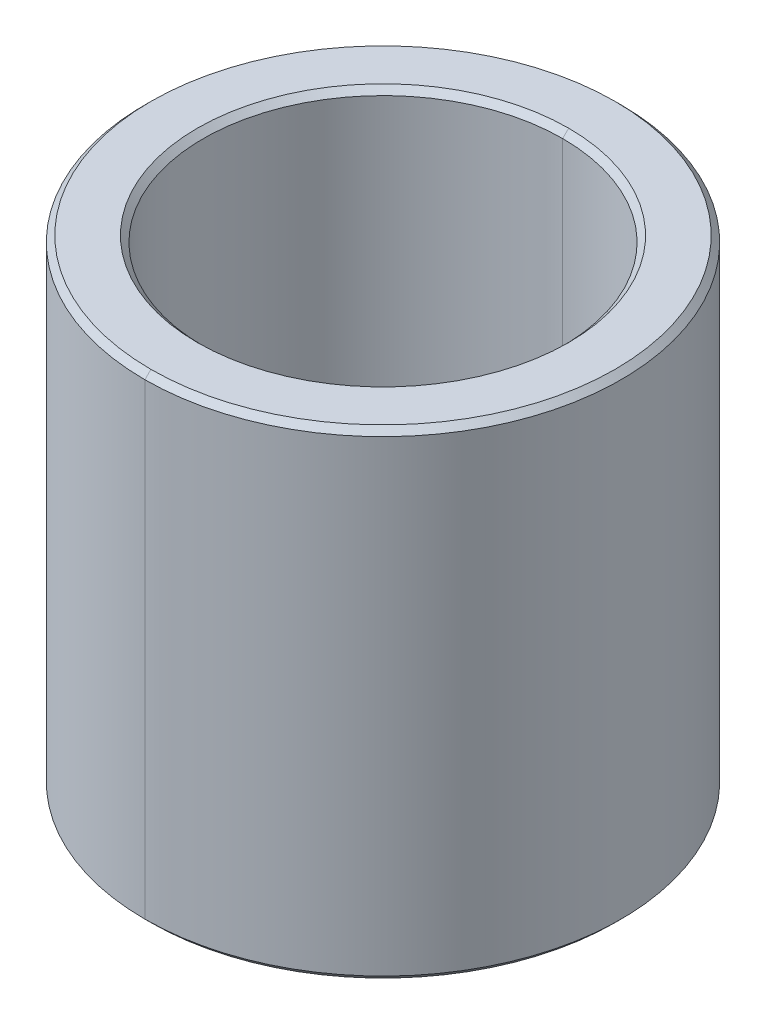
ISO-10303-21;
HEADER;
FILE_DESCRIPTION(('STEP AP214'),'2;1');
FILE_NAME('part.step','',(''),(''),'','','');
FILE_SCHEMA(('AUTOMOTIVE_DESIGN { 1 0 10303 214 1 1 1 1 }'));
ENDSEC;
DATA;
#1=APPLICATION_CONTEXT('core data for automotive mechanical design processes');
#2=APPLICATION_PROTOCOL_DEFINITION('international standard','automotive_design',2000,#1);
#3=PRODUCT_CONTEXT('',#1,'mechanical');
#4=PRODUCT('Part','Part','',(#3));
#5=PRODUCT_RELATED_PRODUCT_CATEGORY('part','',(#4));
#6=PRODUCT_DEFINITION_FORMATION('','',#4);
#7=PRODUCT_DEFINITION_CONTEXT('part definition',#1,'design');
#8=PRODUCT_DEFINITION('design','',#6,#7);
#9=PRODUCT_DEFINITION_SHAPE('','',#8);
#10=(LENGTH_UNIT() NAMED_UNIT(*) SI_UNIT(.MILLI.,.METRE.));
#11=(NAMED_UNIT(*) PLANE_ANGLE_UNIT() SI_UNIT($,.RADIAN.));
#12=(NAMED_UNIT(*) SI_UNIT($,.STERADIAN.) SOLID_ANGLE_UNIT());
#13=UNCERTAINTY_MEASURE_WITH_UNIT(LENGTH_MEASURE(1.E-05),#10,'distance_accuracy_value','');
#14=(GEOMETRIC_REPRESENTATION_CONTEXT(3) GLOBAL_UNCERTAINTY_ASSIGNED_CONTEXT((#13)) GLOBAL_UNIT_ASSIGNED_CONTEXT((#10,
#11,#12)) REPRESENTATION_CONTEXT('',''));
#15=CARTESIAN_POINT('',(0.,0.,0.));
#16=DIRECTION('',(0.,0.,1.));
#17=DIRECTION('',(1.,0.,0.));
#18=AXIS2_PLACEMENT_3D('',#15,#16,#17);
#19=CARTESIAN_POINT('',(0.,3.9,0.));
#20=DIRECTION('',(0.,1.,0.));
#21=DIRECTION('',(0.,0.,1.));
#22=AXIS2_PLACEMENT_3D('',#19,#20,#21);
#23=CONICAL_SURFACE('',#22,3.,0.785398163397452);
#24=DIRECTION('',(0.,0.707106781186544,-0.707106781186551));
#25=VECTOR('',#24,1.);
#26=CARTESIAN_POINT('',(0.,3.9,-3.));
#27=LINE('',#26,#25);
#28=CARTESIAN_POINT('',(0.,3.9,-3.));
#29=VERTEX_POINT('',#28);
#30=CARTESIAN_POINT('',(0.,4.,-3.1));
#31=VERTEX_POINT('',#30);
#32=EDGE_CURVE('E159',#29,#31,#27,.T.);
#33=ORIENTED_EDGE('',*,*,#32,.F.);
#34=CARTESIAN_POINT('',(0.,3.9,0.));
#35=DIRECTION('',(0.,1.,0.));
#36=DIRECTION('',(0.,0.,1.));
#37=AXIS2_PLACEMENT_3D('',#34,#35,#36);
#38=CIRCLE('',#37,3.);
#39=CARTESIAN_POINT('',(0.,3.9,3.));
#40=VERTEX_POINT('',#39);
#41=EDGE_CURVE('E26',#40,#29,#38,.T.);
#42=ORIENTED_EDGE('',*,*,#41,.F.);
#43=DIRECTION('',(0.,0.707106781186544,0.707106781186551));
#44=VECTOR('',#43,1.);
#45=CARTESIAN_POINT('',(0.,3.9,3.));
#46=LINE('',#45,#44);
#47=CARTESIAN_POINT('',(0.,4.,3.1));
#48=VERTEX_POINT('',#47);
#49=EDGE_CURVE('E170',#40,#48,#46,.T.);
#50=ORIENTED_EDGE('',*,*,#49,.T.);
#51=CARTESIAN_POINT('',(0.,4.,0.));
#52=DIRECTION('',(0.,-1.,0.));
#53=DIRECTION('',(0.,0.,1.));
#54=AXIS2_PLACEMENT_3D('',#51,#52,#53);
#55=CIRCLE('',#54,3.1);
#56=EDGE_CURVE('E108',#31,#48,#55,.T.);
#57=ORIENTED_EDGE('',*,*,#56,.F.);
#58=EDGE_LOOP('',(#33,#42,#50,#57));
#59=FACE_BOUND('',#58,.T.);
#60=ADVANCED_FACE('F15',(#59),#23,.F.);
#61=CARTESIAN_POINT('',(0.,-4.,0.));
#62=DIRECTION('',(0.,-1.,0.));
#63=DIRECTION('',(0.,0.,-1.));
#64=AXIS2_PLACEMENT_3D('',#61,#62,#63);
#65=CONICAL_SURFACE('',#64,3.1,0.785398163397448);
#66=DIRECTION('',(0.,-0.707106781186548,0.707106781186548));
#67=VECTOR('',#66,1.);
#68=CARTESIAN_POINT('',(0.,-4.,3.1));
#69=LINE('',#68,#67);
#70=CARTESIAN_POINT('',(0.,-3.9,3.));
#71=VERTEX_POINT('',#70);
#72=CARTESIAN_POINT('',(0.,-4.,3.1));
#73=VERTEX_POINT('',#72);
#74=EDGE_CURVE('E130',#71,#73,#69,.T.);
#75=ORIENTED_EDGE('',*,*,#74,.F.);
#76=CARTESIAN_POINT('',(0.,-3.9,0.));
#77=DIRECTION('',(0.,-1.,0.));
#78=DIRECTION('',(0.,0.,1.));
#79=AXIS2_PLACEMENT_3D('',#76,#77,#78);
#80=CIRCLE('',#79,3.);
#81=CARTESIAN_POINT('',(0.,-3.9,-3.));
#82=VERTEX_POINT('',#81);
#83=EDGE_CURVE('E10',#82,#71,#80,.T.);
#84=ORIENTED_EDGE('',*,*,#83,.F.);
#85=DIRECTION('',(0.,-0.707106781186548,-0.707106781186548));
#86=VECTOR('',#85,1.);
#87=CARTESIAN_POINT('',(0.,-4.,-3.1));
#88=LINE('',#87,#86);
#89=CARTESIAN_POINT('',(0.,-4.,-3.1));
#90=VERTEX_POINT('',#89);
#91=EDGE_CURVE('E163',#82,#90,#88,.T.);
#92=ORIENTED_EDGE('',*,*,#91,.T.);
#93=CARTESIAN_POINT('',(0.,-4.,0.));
#94=DIRECTION('',(0.,1.,0.));
#95=DIRECTION('',(0.,0.,1.));
#96=AXIS2_PLACEMENT_3D('',#93,#94,#95);
#97=CIRCLE('',#96,3.1);
#98=EDGE_CURVE('E107',#73,#90,#97,.T.);
#99=ORIENTED_EDGE('',*,*,#98,.F.);
#100=EDGE_LOOP('',(#75,#84,#92,#99));
#101=FACE_BOUND('',#100,.T.);
#102=ADVANCED_FACE('F227',(#101),#65,.F.);
#103=CARTESIAN_POINT('',(0.,4.,0.));
#104=DIRECTION('',(0.,-1.,0.));
#105=DIRECTION('',(0.,0.,-1.));
#106=AXIS2_PLACEMENT_3D('',#103,#104,#105);
#107=CONICAL_SURFACE('',#106,3.875,0.78539816339744);
#108=DIRECTION('',(0.,-0.707106781186554,0.707106781186542));
#109=VECTOR('',#108,1.);
#110=CARTESIAN_POINT('',(0.,4.,3.875));
#111=LINE('',#110,#109);
#112=CARTESIAN_POINT('',(0.,4.,3.875));
#113=VERTEX_POINT('',#112);
#114=CARTESIAN_POINT('',(0.,3.9,3.975));
#115=VERTEX_POINT('',#114);
#116=EDGE_CURVE('E136',#113,#115,#111,.T.);
#117=ORIENTED_EDGE('',*,*,#116,.F.);
#118=CARTESIAN_POINT('',(0.,4.,0.));
#119=DIRECTION('',(0.,1.,0.));
#120=DIRECTION('',(0.,0.,1.));
#121=AXIS2_PLACEMENT_3D('',#118,#119,#120);
#122=CIRCLE('',#121,3.875);
#123=CARTESIAN_POINT('',(0.,4.,-3.875));
#124=VERTEX_POINT('',#123);
#125=EDGE_CURVE('E180',#124,#113,#122,.T.);
#126=ORIENTED_EDGE('',*,*,#125,.F.);
#127=DIRECTION('',(0.,-0.707106781186554,-0.707106781186542));
#128=VECTOR('',#127,1.);
#129=CARTESIAN_POINT('',(0.,4.,-3.875));
#130=LINE('',#129,#128);
#131=CARTESIAN_POINT('',(0.,3.9,-3.975));
#132=VERTEX_POINT('',#131);
#133=EDGE_CURVE('E119',#124,#132,#130,.T.);
#134=ORIENTED_EDGE('',*,*,#133,.T.);
#135=CARTESIAN_POINT('',(0.,3.9,0.));
#136=DIRECTION('',(0.,-1.,0.));
#137=DIRECTION('',(0.,0.,1.));
#138=AXIS2_PLACEMENT_3D('',#135,#136,#137);
#139=CIRCLE('',#138,3.975);
#140=EDGE_CURVE('E166',#115,#132,#139,.T.);
#141=ORIENTED_EDGE('',*,*,#140,.F.);
#142=EDGE_LOOP('',(#117,#126,#134,#141));
#143=FACE_BOUND('',#142,.T.);
#144=ADVANCED_FACE('F247',(#143),#107,.T.);
#145=CARTESIAN_POINT('',(0.,-3.9,0.));
#146=DIRECTION('',(0.,1.,0.));
#147=DIRECTION('',(0.,0.,1.));
#148=AXIS2_PLACEMENT_3D('',#145,#146,#147);
#149=CONICAL_SURFACE('',#148,3.975,0.785398163397452);
#150=DIRECTION('',(0.,0.707106781186545,-0.707106781186551));
#151=VECTOR('',#150,1.);
#152=CARTESIAN_POINT('',(0.,-3.9,-3.975));
#153=LINE('',#152,#151);
#154=CARTESIAN_POINT('',(0.,-4.,-3.875));
#155=VERTEX_POINT('',#154);
#156=CARTESIAN_POINT('',(0.,-3.9,-3.975));
#157=VERTEX_POINT('',#156);
#158=EDGE_CURVE('E111',#155,#157,#153,.T.);
#159=ORIENTED_EDGE('',*,*,#158,.F.);
#160=CARTESIAN_POINT('',(0.,-4.,0.));
#161=DIRECTION('',(0.,-1.,0.));
#162=DIRECTION('',(0.,0.,1.));
#163=AXIS2_PLACEMENT_3D('',#160,#161,#162);
#164=CIRCLE('',#163,3.875);
#165=CARTESIAN_POINT('',(0.,-4.,3.875));
#166=VERTEX_POINT('',#165);
#167=EDGE_CURVE('E98',#166,#155,#164,.T.);
#168=ORIENTED_EDGE('',*,*,#167,.F.);
#169=DIRECTION('',(0.,0.707106781186545,0.707106781186551));
#170=VECTOR('',#169,1.);
#171=CARTESIAN_POINT('',(0.,-3.9,3.975));
#172=LINE('',#171,#170);
#173=CARTESIAN_POINT('',(0.,-3.9,3.975));
#174=VERTEX_POINT('',#173);
#175=EDGE_CURVE('E117',#166,#174,#172,.T.);
#176=ORIENTED_EDGE('',*,*,#175,.T.);
#177=CARTESIAN_POINT('',(0.,-3.9,0.));
#178=DIRECTION('',(0.,1.,0.));
#179=DIRECTION('',(0.,0.,1.));
#180=AXIS2_PLACEMENT_3D('',#177,#178,#179);
#181=CIRCLE('',#180,3.975);
#182=EDGE_CURVE('E41',#157,#174,#181,.T.);
#183=ORIENTED_EDGE('',*,*,#182,.F.);
#184=EDGE_LOOP('',(#159,#168,#176,#183));
#185=FACE_BOUND('',#184,.T.);
#186=ADVANCED_FACE('F17',(#185),#149,.T.);
#187=CARTESIAN_POINT('',(0.,4.,0.));
#188=DIRECTION('',(0.,-1.,0.));
#189=DIRECTION('',(0.,0.,-1.));
#190=AXIS2_PLACEMENT_3D('',#187,#188,#189);
#191=CYLINDRICAL_SURFACE('',#190,3.);
#192=DIRECTION('',(0.,-1.,0.));
#193=VECTOR('',#192,1.);
#194=CARTESIAN_POINT('',(0.,4.,3.));
#195=LINE('',#194,#193);
#196=EDGE_CURVE('E145',#40,#71,#195,.T.);
#197=ORIENTED_EDGE('',*,*,#196,.F.);
#198=ORIENTED_EDGE('',*,*,#41,.T.);
#199=DIRECTION('',(0.,-1.,0.));
#200=VECTOR('',#199,1.);
#201=CARTESIAN_POINT('',(0.,4.,-3.));
#202=LINE('',#201,#200);
#203=EDGE_CURVE('E141',#29,#82,#202,.T.);
#204=ORIENTED_EDGE('',*,*,#203,.T.);
#205=ORIENTED_EDGE('',*,*,#83,.T.);
#206=EDGE_LOOP('',(#197,#198,#204,#205));
#207=FACE_BOUND('',#206,.T.);
#208=ADVANCED_FACE('F220',(#207),#191,.F.);
#209=CARTESIAN_POINT('',(0.,4.,0.));
#210=DIRECTION('',(0.,-1.,0.));
#211=DIRECTION('',(0.,0.,-1.));
#212=AXIS2_PLACEMENT_3D('',#209,#210,#211);
#213=CYLINDRICAL_SURFACE('',#212,3.975);
#214=DIRECTION('',(0.,-1.,0.));
#215=VECTOR('',#214,1.);
#216=CARTESIAN_POINT('',(0.,4.,3.975));
#217=LINE('',#216,#215);
#218=EDGE_CURVE('E144',#115,#174,#217,.T.);
#219=ORIENTED_EDGE('',*,*,#218,.F.);
#220=ORIENTED_EDGE('',*,*,#140,.T.);
#221=DIRECTION('',(0.,-1.,0.));
#222=VECTOR('',#221,1.);
#223=CARTESIAN_POINT('',(0.,4.,-3.975));
#224=LINE('',#223,#222);
#225=EDGE_CURVE('E152',#132,#157,#224,.T.);
#226=ORIENTED_EDGE('',*,*,#225,.T.);
#227=ORIENTED_EDGE('',*,*,#182,.T.);
#228=EDGE_LOOP('',(#219,#220,#226,#227));
#229=FACE_BOUND('',#228,.T.);
#230=ADVANCED_FACE('F230',(#229),#213,.T.);
#231=CARTESIAN_POINT('',(0.,-4.,0.));
#232=DIRECTION('',(0.,1.,0.));
#233=DIRECTION('',(1.,0.,0.));
#234=AXIS2_PLACEMENT_3D('',#231,#232,#233);
#235=PLANE('',#234);
#236=CARTESIAN_POINT('',(0.,-4.,0.));
#237=DIRECTION('',(0.,1.,0.));
#238=DIRECTION('',(0.,0.,1.));
#239=AXIS2_PLACEMENT_3D('',#236,#237,#238);
#240=CIRCLE('',#239,3.1);
#241=EDGE_CURVE('E134',#90,#73,#240,.T.);
#242=ORIENTED_EDGE('',*,*,#241,.T.);
#243=ORIENTED_EDGE('',*,*,#98,.T.);
#244=EDGE_LOOP('',(#242,#243));
#245=FACE_BOUND('',#244,.T.);
#246=ORIENTED_EDGE('',*,*,#167,.T.);
#247=CARTESIAN_POINT('',(0.,-4.,0.));
#248=DIRECTION('',(0.,-1.,0.));
#249=DIRECTION('',(0.,0.,1.));
#250=AXIS2_PLACEMENT_3D('',#247,#248,#249);
#251=CIRCLE('',#250,3.875);
#252=EDGE_CURVE('E102',#155,#166,#251,.T.);
#253=ORIENTED_EDGE('',*,*,#252,.T.);
#254=EDGE_LOOP('',(#246,#253));
#255=FACE_BOUND('',#254,.T.);
#256=ADVANCED_FACE('F100',(#245,#255),#235,.F.);
#257=CARTESIAN_POINT('',(0.,4.,0.));
#258=DIRECTION('',(0.,1.,0.));
#259=DIRECTION('',(1.,0.,0.));
#260=AXIS2_PLACEMENT_3D('',#257,#258,#259);
#261=PLANE('',#260);
#262=CARTESIAN_POINT('',(0.,4.,0.));
#263=DIRECTION('',(0.,-1.,0.));
#264=DIRECTION('',(0.,0.,1.));
#265=AXIS2_PLACEMENT_3D('',#262,#263,#264);
#266=CIRCLE('',#265,3.1);
#267=EDGE_CURVE('E171',#48,#31,#266,.T.);
#268=ORIENTED_EDGE('',*,*,#267,.T.);
#269=ORIENTED_EDGE('',*,*,#56,.T.);
#270=EDGE_LOOP('',(#268,#269));
#271=FACE_BOUND('',#270,.T.);
#272=ORIENTED_EDGE('',*,*,#125,.T.);
#273=CARTESIAN_POINT('',(0.,4.,0.));
#274=DIRECTION('',(0.,1.,0.));
#275=DIRECTION('',(0.,0.,1.));
#276=AXIS2_PLACEMENT_3D('',#273,#274,#275);
#277=CIRCLE('',#276,3.875);
#278=EDGE_CURVE('E140',#113,#124,#277,.T.);
#279=ORIENTED_EDGE('',*,*,#278,.T.);
#280=EDGE_LOOP('',(#272,#279));
#281=FACE_BOUND('',#280,.T.);
#282=ADVANCED_FACE('F203',(#271,#281),#261,.T.);
#283=CARTESIAN_POINT('',(0.,4.,0.));
#284=DIRECTION('',(0.,-1.,0.));
#285=DIRECTION('',(0.,0.,-1.));
#286=AXIS2_PLACEMENT_3D('',#283,#284,#285);
#287=CYLINDRICAL_SURFACE('',#286,3.975);
#288=CARTESIAN_POINT('',(0.,3.9,0.));
#289=DIRECTION('',(0.,-1.,0.));
#290=DIRECTION('',(0.,0.,1.));
#291=AXIS2_PLACEMENT_3D('',#288,#289,#290);
#292=CIRCLE('',#291,3.975);
#293=EDGE_CURVE('E126',#132,#115,#292,.T.);
#294=ORIENTED_EDGE('',*,*,#293,.T.);
#295=ORIENTED_EDGE('',*,*,#218,.T.);
#296=CARTESIAN_POINT('',(0.,-3.9,0.));
#297=DIRECTION('',(0.,1.,0.));
#298=DIRECTION('',(0.,0.,1.));
#299=AXIS2_PLACEMENT_3D('',#296,#297,#298);
#300=CIRCLE('',#299,3.975);
#301=EDGE_CURVE('E19',#174,#157,#300,.T.);
#302=ORIENTED_EDGE('',*,*,#301,.T.);
#303=ORIENTED_EDGE('',*,*,#225,.F.);
#304=EDGE_LOOP('',(#294,#295,#302,#303));
#305=FACE_BOUND('',#304,.T.);
#306=ADVANCED_FACE('F237',(#305),#287,.T.);
#307=CARTESIAN_POINT('',(0.,4.,0.));
#308=DIRECTION('',(0.,-1.,0.));
#309=DIRECTION('',(0.,0.,-1.));
#310=AXIS2_PLACEMENT_3D('',#307,#308,#309);
#311=CYLINDRICAL_SURFACE('',#310,3.);
#312=CARTESIAN_POINT('',(0.,3.9,0.));
#313=DIRECTION('',(0.,1.,0.));
#314=DIRECTION('',(0.,0.,1.));
#315=AXIS2_PLACEMENT_3D('',#312,#313,#314);
#316=CIRCLE('',#315,3.);
#317=EDGE_CURVE('E155',#29,#40,#316,.T.);
#318=ORIENTED_EDGE('',*,*,#317,.T.);
#319=ORIENTED_EDGE('',*,*,#196,.T.);
#320=CARTESIAN_POINT('',(0.,-3.9,0.));
#321=DIRECTION('',(0.,-1.,0.));
#322=DIRECTION('',(0.,0.,1.));
#323=AXIS2_PLACEMENT_3D('',#320,#321,#322);
#324=CIRCLE('',#323,3.);
#325=EDGE_CURVE('E135',#71,#82,#324,.T.);
#326=ORIENTED_EDGE('',*,*,#325,.T.);
#327=ORIENTED_EDGE('',*,*,#203,.F.);
#328=EDGE_LOOP('',(#318,#319,#326,#327));
#329=FACE_BOUND('',#328,.T.);
#330=ADVANCED_FACE('F215',(#329),#311,.F.);
#331=CARTESIAN_POINT('',(0.,-3.9,0.));
#332=DIRECTION('',(0.,1.,0.));
#333=DIRECTION('',(0.,0.,1.));
#334=AXIS2_PLACEMENT_3D('',#331,#332,#333);
#335=CONICAL_SURFACE('',#334,3.975,0.785398163397452);
#336=ORIENTED_EDGE('',*,*,#252,.F.);
#337=ORIENTED_EDGE('',*,*,#158,.T.);
#338=ORIENTED_EDGE('',*,*,#301,.F.);
#339=ORIENTED_EDGE('',*,*,#175,.F.);
#340=EDGE_LOOP('',(#336,#337,#338,#339));
#341=FACE_BOUND('',#340,.T.);
#342=ADVANCED_FACE('F116',(#341),#335,.T.);
#343=CARTESIAN_POINT('',(0.,4.,0.));
#344=DIRECTION('',(0.,-1.,0.));
#345=DIRECTION('',(0.,0.,-1.));
#346=AXIS2_PLACEMENT_3D('',#343,#344,#345);
#347=CONICAL_SURFACE('',#346,3.875,0.78539816339744);
#348=ORIENTED_EDGE('',*,*,#278,.F.);
#349=ORIENTED_EDGE('',*,*,#116,.T.);
#350=ORIENTED_EDGE('',*,*,#293,.F.);
#351=ORIENTED_EDGE('',*,*,#133,.F.);
#352=EDGE_LOOP('',(#348,#349,#350,#351));
#353=FACE_BOUND('',#352,.T.);
#354=ADVANCED_FACE('F254',(#353),#347,.T.);
#355=CARTESIAN_POINT('',(0.,-4.,0.));
#356=DIRECTION('',(0.,-1.,0.));
#357=DIRECTION('',(0.,0.,-1.));
#358=AXIS2_PLACEMENT_3D('',#355,#356,#357);
#359=CONICAL_SURFACE('',#358,3.1,0.785398163397448);
#360=ORIENTED_EDGE('',*,*,#325,.F.);
#361=ORIENTED_EDGE('',*,*,#74,.T.);
#362=ORIENTED_EDGE('',*,*,#241,.F.);
#363=ORIENTED_EDGE('',*,*,#91,.F.);
#364=EDGE_LOOP('',(#360,#361,#362,#363));
#365=FACE_BOUND('',#364,.T.);
#366=ADVANCED_FACE('F225',(#365),#359,.F.);
#367=CARTESIAN_POINT('',(0.,3.9,0.));
#368=DIRECTION('',(0.,1.,0.));
#369=DIRECTION('',(0.,0.,1.));
#370=AXIS2_PLACEMENT_3D('',#367,#368,#369);
#371=CONICAL_SURFACE('',#370,3.,0.785398163397452);
#372=ORIENTED_EDGE('',*,*,#317,.F.);
#373=ORIENTED_EDGE('',*,*,#32,.T.);
#374=ORIENTED_EDGE('',*,*,#267,.F.);
#375=ORIENTED_EDGE('',*,*,#49,.F.);
#376=EDGE_LOOP('',(#372,#373,#374,#375));
#377=FACE_BOUND('',#376,.T.);
#378=ADVANCED_FACE('F212',(#377),#371,.F.);
#379=CLOSED_SHELL('',(#60,#102,#144,#186,#208,#230,#256,#282,#306,#330,#342,#354,#366,#378));
#380=MANIFOLD_SOLID_BREP('B1',#379);
#381=ADVANCED_BREP_SHAPE_REPRESENTATION('',(#18,#380),#14);
#382=SHAPE_DEFINITION_REPRESENTATION(#9,#381);
ENDSEC;
END-ISO-10303-21;
